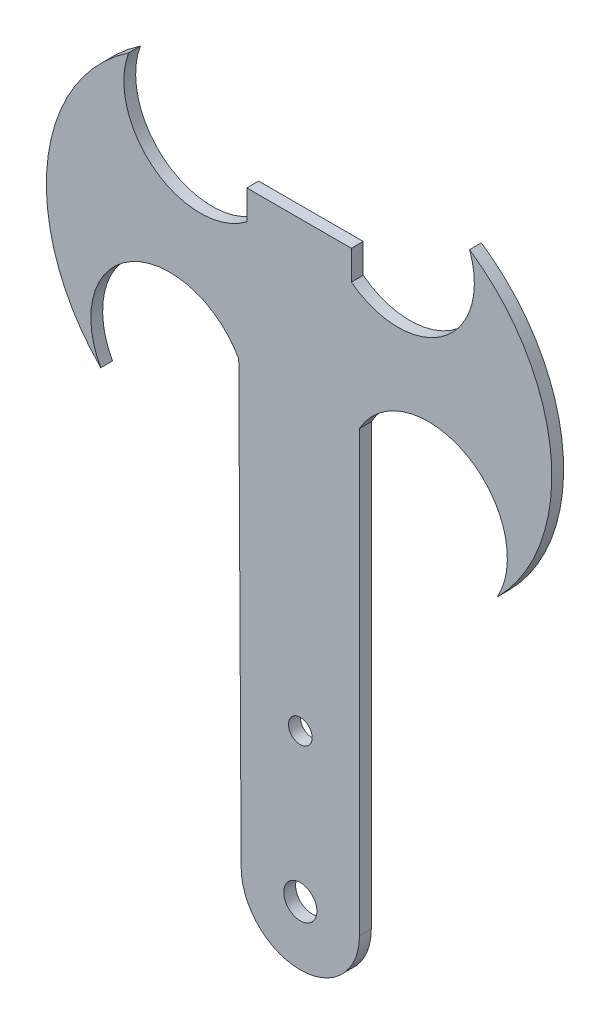
ISO-10303-21;
HEADER;
FILE_DESCRIPTION(('STEP AP214'),'2;1');
FILE_NAME('part.step','',(''),(''),'','','');
FILE_SCHEMA(('AUTOMOTIVE_DESIGN { 1 0 10303 214 1 1 1 1 }'));
ENDSEC;
DATA;
#1=APPLICATION_CONTEXT('core data for automotive mechanical design processes');
#2=APPLICATION_PROTOCOL_DEFINITION('international standard','automotive_design',2000,#1);
#3=PRODUCT_CONTEXT('',#1,'mechanical');
#4=PRODUCT('Part','Part','',(#3));
#5=PRODUCT_RELATED_PRODUCT_CATEGORY('part','',(#4));
#6=PRODUCT_DEFINITION_FORMATION('','',#4);
#7=PRODUCT_DEFINITION_CONTEXT('part definition',#1,'design');
#8=PRODUCT_DEFINITION('design','',#6,#7);
#9=PRODUCT_DEFINITION_SHAPE('','',#8);
#10=(LENGTH_UNIT() NAMED_UNIT(*) SI_UNIT(.MILLI.,.METRE.));
#11=(NAMED_UNIT(*) PLANE_ANGLE_UNIT() SI_UNIT($,.RADIAN.));
#12=(NAMED_UNIT(*) SI_UNIT($,.STERADIAN.) SOLID_ANGLE_UNIT());
#13=UNCERTAINTY_MEASURE_WITH_UNIT(LENGTH_MEASURE(1.E-05),#10,'distance_accuracy_value','');
#14=(GEOMETRIC_REPRESENTATION_CONTEXT(3) GLOBAL_UNCERTAINTY_ASSIGNED_CONTEXT((#13)) GLOBAL_UNIT_ASSIGNED_CONTEXT((#10,
#11,#12)) REPRESENTATION_CONTEXT('',''));
#15=CARTESIAN_POINT('',(0.,0.,0.));
#16=DIRECTION('',(0.,0.,1.));
#17=DIRECTION('',(1.,0.,0.));
#18=AXIS2_PLACEMENT_3D('',#15,#16,#17);
#19=CARTESIAN_POINT('',(34.1671418096591,18.1404890832739,-1.));
#20=DIRECTION('',(0.,0.,1.));
#21=DIRECTION('',(1.,0.,0.));
#22=AXIS2_PLACEMENT_3D('',#19,#20,#21);
#23=CYLINDRICAL_SURFACE('',#22,6.67397065018017);
#24=CARTESIAN_POINT('',(34.1671418096591,18.1404890832739,0.));
#25=DIRECTION('',(0.,0.,-1.));
#26=DIRECTION('',(1.,0.,0.));
#27=AXIS2_PLACEMENT_3D('',#24,#25,#26);
#28=CIRCLE('',#27,6.67397065018017);
#29=CARTESIAN_POINT('',(28.3342836193181,14.8970881566478,0.));
#30=VERTEX_POINT('',#29);
#31=CARTESIAN_POINT('',(40.,21.3838900099,0.));
#32=VERTEX_POINT('',#31);
#33=EDGE_CURVE('E158',#30,#32,#28,.T.);
#34=ORIENTED_EDGE('',*,*,#33,.F.);
#35=DIRECTION('',(0.,0.,1.));
#36=VECTOR('',#35,1.);
#37=CARTESIAN_POINT('',(28.3342836193181,14.8970881566478,-1.));
#38=LINE('',#37,#36);
#39=CARTESIAN_POINT('',(28.3342836193181,14.8970881566478,-1.));
#40=VERTEX_POINT('',#39);
#41=EDGE_CURVE('E11',#40,#30,#38,.T.);
#42=ORIENTED_EDGE('',*,*,#41,.F.);
#43=CARTESIAN_POINT('',(34.1671418096591,18.1404890832739,-1.));
#44=DIRECTION('',(0.,0.,-1.));
#45=DIRECTION('',(1.,0.,0.));
#46=AXIS2_PLACEMENT_3D('',#43,#44,#45);
#47=CIRCLE('',#46,6.67397065018017);
#48=CARTESIAN_POINT('',(40.,21.3838900099,-1.));
#49=VERTEX_POINT('',#48);
#50=EDGE_CURVE('E191',#40,#49,#47,.T.);
#51=ORIENTED_EDGE('',*,*,#50,.T.);
#52=DIRECTION('',(0.,0.,1.));
#53=VECTOR('',#52,1.);
#54=CARTESIAN_POINT('',(40.,21.3838900099,-1.));
#55=LINE('',#54,#53);
#56=EDGE_CURVE('E40',#49,#32,#55,.T.);
#57=ORIENTED_EDGE('',*,*,#56,.T.);
#58=EDGE_LOOP('',(#34,#42,#51,#57));
#59=FACE_BOUND('',#58,.T.);
#60=ADVANCED_FACE('F37',(#59),#23,.F.);
#61=CARTESIAN_POINT('',(39.5394646865,26.0428552188,-1.));
#62=DIRECTION('',(0.,0.,1.));
#63=DIRECTION('',(1.,0.,0.));
#64=AXIS2_PLACEMENT_3D('',#61,#62,#63);
#65=CYLINDRICAL_SURFACE('',#64,15.8045628269841);
#66=CARTESIAN_POINT('',(39.5394646865,26.0428552188,0.));
#67=DIRECTION('',(0.,0.,1.));
#68=DIRECTION('',(1.,0.,0.));
#69=AXIS2_PLACEMENT_3D('',#66,#67,#68);
#70=CIRCLE('',#69,15.8045628269841);
#71=CARTESIAN_POINT('',(30.6895364843728,39.137242450331,0.));
#72=VERTEX_POINT('',#71);
#73=EDGE_CURVE('E189',#72,#30,#70,.T.);
#74=ORIENTED_EDGE('',*,*,#73,.F.);
#75=DIRECTION('',(0.,0.,1.));
#76=VECTOR('',#75,1.);
#77=CARTESIAN_POINT('',(30.6895364843728,39.137242450331,-1.));
#78=LINE('',#77,#76);
#79=CARTESIAN_POINT('',(30.6895364843728,39.137242450331,-1.));
#80=VERTEX_POINT('',#79);
#81=EDGE_CURVE('E46',#80,#72,#78,.T.);
#82=ORIENTED_EDGE('',*,*,#81,.F.);
#83=CARTESIAN_POINT('',(39.5394646865,26.0428552188,-1.));
#84=DIRECTION('',(0.,0.,1.));
#85=DIRECTION('',(1.,0.,0.));
#86=AXIS2_PLACEMENT_3D('',#83,#84,#85);
#87=CIRCLE('',#86,15.8045628269841);
#88=EDGE_CURVE('E148',#80,#40,#87,.T.);
#89=ORIENTED_EDGE('',*,*,#88,.T.);
#90=ORIENTED_EDGE('',*,*,#41,.T.);
#91=EDGE_LOOP('',(#74,#82,#89,#90));
#92=FACE_BOUND('',#91,.T.);
#93=ADVANCED_FACE('F211',(#92),#65,.T.);
#94=CARTESIAN_POINT('',(36.7445164078923,36.8849972617035,-1.));
#95=DIRECTION('',(0.,0.,1.));
#96=DIRECTION('',(1.,0.,0.));
#97=AXIS2_PLACEMENT_3D('',#94,#95,#96);
#98=CYLINDRICAL_SURFACE('',#97,6.46029335741965);
#99=CARTESIAN_POINT('',(36.7445164078923,36.8849972617035,0.));
#100=DIRECTION('',(0.,0.,-1.));
#101=DIRECTION('',(1.,0.,0.));
#102=AXIS2_PLACEMENT_3D('',#99,#100,#101);
#103=CIRCLE('',#102,6.46029335741965);
#104=CARTESIAN_POINT('',(40.6819678488,31.7632918412,0.));
#105=VERTEX_POINT('',#104);
#106=EDGE_CURVE('E135',#105,#72,#103,.T.);
#107=ORIENTED_EDGE('',*,*,#106,.F.);
#108=DIRECTION('',(0.,0.,1.));
#109=VECTOR('',#108,1.);
#110=CARTESIAN_POINT('',(40.6819678488,31.7632918412,-1.));
#111=LINE('',#110,#109);
#112=CARTESIAN_POINT('',(40.6819678488,31.7632918412,-1.));
#113=VERTEX_POINT('',#112);
#114=EDGE_CURVE('E130',#113,#105,#111,.T.);
#115=ORIENTED_EDGE('',*,*,#114,.F.);
#116=CARTESIAN_POINT('',(36.7445164078923,36.8849972617035,-1.));
#117=DIRECTION('',(0.,0.,-1.));
#118=DIRECTION('',(1.,0.,0.));
#119=AXIS2_PLACEMENT_3D('',#116,#117,#118);
#120=CIRCLE('',#119,6.46029335741965);
#121=EDGE_CURVE('E133',#113,#80,#120,.T.);
#122=ORIENTED_EDGE('',*,*,#121,.T.);
#123=ORIENTED_EDGE('',*,*,#81,.T.);
#124=EDGE_LOOP('',(#107,#115,#122,#123));
#125=FACE_BOUND('',#124,.T.);
#126=ADVANCED_FACE('F132',(#125),#98,.F.);
#127=CARTESIAN_POINT('',(40.6819678488,34.2436901751,-1.));
#128=DIRECTION('',(-1.,0.,0.));
#129=DIRECTION('',(0.,0.,1.));
#130=AXIS2_PLACEMENT_3D('',#127,#128,#129);
#131=PLANE('',#130);
#132=DIRECTION('',(0.,-1.,0.));
#133=VECTOR('',#132,1.);
#134=CARTESIAN_POINT('',(40.6819678488,34.2436901751,0.));
#135=LINE('',#134,#133);
#136=CARTESIAN_POINT('',(40.6819678488,34.2436901751,0.));
#137=VERTEX_POINT('',#136);
#138=EDGE_CURVE('E186',#137,#105,#135,.T.);
#139=ORIENTED_EDGE('',*,*,#138,.F.);
#140=DIRECTION('',(0.,0.,1.));
#141=VECTOR('',#140,1.);
#142=CARTESIAN_POINT('',(40.6819678488,34.2436901751,-1.));
#143=LINE('',#142,#141);
#144=CARTESIAN_POINT('',(40.6819678488,34.2436901751,-1.));
#145=VERTEX_POINT('',#144);
#146=EDGE_CURVE('E140',#145,#137,#143,.T.);
#147=ORIENTED_EDGE('',*,*,#146,.F.);
#148=DIRECTION('',(0.,-1.,0.));
#149=VECTOR('',#148,1.);
#150=CARTESIAN_POINT('',(40.6819678488,34.2436901751,-1.));
#151=LINE('',#150,#149);
#152=EDGE_CURVE('E146',#145,#113,#151,.T.);
#153=ORIENTED_EDGE('',*,*,#152,.T.);
#154=ORIENTED_EDGE('',*,*,#114,.T.);
#155=EDGE_LOOP('',(#139,#147,#153,#154));
#156=FACE_BOUND('',#155,.T.);
#157=ADVANCED_FACE('F150',(#156),#131,.T.);
#158=CARTESIAN_POINT('',(49.5240225671,34.2436901751,-1.));
#159=DIRECTION('',(0.,1.,0.));
#160=DIRECTION('',(0.,0.,1.));
#161=AXIS2_PLACEMENT_3D('',#158,#159,#160);
#162=PLANE('',#161);
#163=DIRECTION('',(-1.,0.,0.));
#164=VECTOR('',#163,1.);
#165=CARTESIAN_POINT('',(49.5240225671,34.2436901751,0.));
#166=LINE('',#165,#164);
#167=CARTESIAN_POINT('',(49.5240225671,34.2436901751,0.));
#168=VERTEX_POINT('',#167);
#169=EDGE_CURVE('E183',#168,#137,#166,.T.);
#170=ORIENTED_EDGE('',*,*,#169,.F.);
#171=DIRECTION('',(0.,0.,1.));
#172=VECTOR('',#171,1.);
#173=CARTESIAN_POINT('',(49.5240225671,34.2436901751,-1.));
#174=LINE('',#173,#172);
#175=CARTESIAN_POINT('',(49.5240225671,34.2436901751,-1.));
#176=VERTEX_POINT('',#175);
#177=EDGE_CURVE('E195',#176,#168,#174,.T.);
#178=ORIENTED_EDGE('',*,*,#177,.F.);
#179=DIRECTION('',(-1.,0.,0.));
#180=VECTOR('',#179,1.);
#181=CARTESIAN_POINT('',(49.5240225671,34.2436901751,-1.));
#182=LINE('',#181,#180);
#183=EDGE_CURVE('E151',#176,#145,#182,.T.);
#184=ORIENTED_EDGE('',*,*,#183,.T.);
#185=ORIENTED_EDGE('',*,*,#146,.T.);
#186=EDGE_LOOP('',(#170,#178,#184,#185));
#187=FACE_BOUND('',#186,.T.);
#188=ADVANCED_FACE('F224',(#187),#162,.T.);
#189=CARTESIAN_POINT('',(49.5240225671,31.7632918412,-1.));
#190=DIRECTION('',(1.,0.,0.));
#191=DIRECTION('',(0.,0.,-1.));
#192=AXIS2_PLACEMENT_3D('',#189,#190,#191);
#193=PLANE('',#192);
#194=DIRECTION('',(0.,1.,0.));
#195=VECTOR('',#194,1.);
#196=CARTESIAN_POINT('',(49.5240225671,31.7632918412,0.));
#197=LINE('',#196,#195);
#198=CARTESIAN_POINT('',(49.5240225671,31.7632918412,0.));
#199=VERTEX_POINT('',#198);
#200=EDGE_CURVE('E180',#199,#168,#197,.T.);
#201=ORIENTED_EDGE('',*,*,#200,.F.);
#202=DIRECTION('',(0.,0.,1.));
#203=VECTOR('',#202,1.);
#204=CARTESIAN_POINT('',(49.5240225671,31.7632918412,-1.));
#205=LINE('',#204,#203);
#206=CARTESIAN_POINT('',(49.5240225671,31.7632918412,-1.));
#207=VERTEX_POINT('',#206);
#208=EDGE_CURVE('E197',#207,#199,#205,.T.);
#209=ORIENTED_EDGE('',*,*,#208,.F.);
#210=DIRECTION('',(0.,1.,0.));
#211=VECTOR('',#210,1.);
#212=CARTESIAN_POINT('',(49.5240225671,31.7632918412,-1.));
#213=LINE('',#212,#211);
#214=EDGE_CURVE('E153',#207,#176,#213,.T.);
#215=ORIENTED_EDGE('',*,*,#214,.T.);
#216=ORIENTED_EDGE('',*,*,#177,.T.);
#217=EDGE_LOOP('',(#201,#209,#215,#216));
#218=FACE_BOUND('',#217,.T.);
#219=ADVANCED_FACE('F227',(#218),#193,.T.);
#220=CARTESIAN_POINT('',(53.4614740079072,36.8849972617807,-1.));
#221=DIRECTION('',(0.,0.,1.));
#222=DIRECTION('',(1.,0.,0.));
#223=AXIS2_PLACEMENT_3D('',#220,#221,#222);
#224=CYLINDRICAL_SURFACE('',#223,6.46029335741965);
#225=CARTESIAN_POINT('',(53.4614740079072,36.8849972617807,0.));
#226=DIRECTION('',(0.,0.,-1.));
#227=DIRECTION('',(1.,0.,0.));
#228=AXIS2_PLACEMENT_3D('',#225,#226,#227);
#229=CIRCLE('',#228,6.46029335741965);
#230=CARTESIAN_POINT('',(59.5164539314506,39.137242450344,0.));
#231=VERTEX_POINT('',#230);
#232=EDGE_CURVE('E177',#231,#199,#229,.T.);
#233=ORIENTED_EDGE('',*,*,#232,.F.);
#234=DIRECTION('',(0.,0.,1.));
#235=VECTOR('',#234,1.);
#236=CARTESIAN_POINT('',(59.5164539314506,39.137242450344,-1.));
#237=LINE('',#236,#235);
#238=CARTESIAN_POINT('',(59.5164539314506,39.137242450344,-1.));
#239=VERTEX_POINT('',#238);
#240=EDGE_CURVE('E199',#239,#231,#237,.T.);
#241=ORIENTED_EDGE('',*,*,#240,.F.);
#242=CARTESIAN_POINT('',(53.4614740079072,36.8849972617807,-1.));
#243=DIRECTION('',(0.,0.,-1.));
#244=DIRECTION('',(1.,0.,0.));
#245=AXIS2_PLACEMENT_3D('',#242,#243,#244);
#246=CIRCLE('',#245,6.46029335741965);
#247=EDGE_CURVE('E301',#239,#207,#246,.T.);
#248=ORIENTED_EDGE('',*,*,#247,.T.);
#249=ORIENTED_EDGE('',*,*,#208,.T.);
#250=EDGE_LOOP('',(#233,#241,#248,#249));
#251=FACE_BOUND('',#250,.T.);
#252=ADVANCED_FACE('F231',(#251),#224,.F.);
#253=CARTESIAN_POINT('',(50.6665257293172,26.0428552188173,-1.));
#254=DIRECTION('',(0.,0.,1.));
#255=DIRECTION('',(1.,0.,0.));
#256=AXIS2_PLACEMENT_3D('',#253,#254,#255);
#257=CYLINDRICAL_SURFACE('',#256,15.8045628269841);
#258=CARTESIAN_POINT('',(50.6665257293172,26.0428552188173,0.));
#259=DIRECTION('',(0.,0.,1.));
#260=DIRECTION('',(1.,0.,0.));
#261=AXIS2_PLACEMENT_3D('',#258,#259,#260);
#262=CIRCLE('',#261,15.8045628269841);
#263=CARTESIAN_POINT('',(61.8717067965013,14.8970881566674,0.));
#264=VERTEX_POINT('',#263);
#265=EDGE_CURVE('E174',#264,#231,#262,.T.);
#266=ORIENTED_EDGE('',*,*,#265,.F.);
#267=DIRECTION('',(0.,0.,1.));
#268=VECTOR('',#267,1.);
#269=CARTESIAN_POINT('',(61.8717067965013,14.8970881566674,-1.));
#270=LINE('',#269,#268);
#271=CARTESIAN_POINT('',(61.8717067965013,14.8970881566674,-1.));
#272=VERTEX_POINT('',#271);
#273=EDGE_CURVE('E201',#272,#264,#270,.T.);
#274=ORIENTED_EDGE('',*,*,#273,.F.);
#275=CARTESIAN_POINT('',(50.6665257293172,26.0428552188173,-1.));
#276=DIRECTION('',(0.,0.,1.));
#277=DIRECTION('',(1.,0.,0.));
#278=AXIS2_PLACEMENT_3D('',#275,#276,#277);
#279=CIRCLE('',#278,15.8045628269841);
#280=EDGE_CURVE('E298',#272,#239,#279,.T.);
#281=ORIENTED_EDGE('',*,*,#280,.T.);
#282=ORIENTED_EDGE('',*,*,#240,.T.);
#283=EDGE_LOOP('',(#266,#274,#281,#282));
#284=FACE_BOUND('',#283,.T.);
#285=ADVANCED_FACE('F235',(#284),#257,.T.);
#286=CARTESIAN_POINT('',(56.0388486061507,18.1404890832837,-1.));
#287=DIRECTION('',(0.,0.,1.));
#288=DIRECTION('',(1.,0.,0.));
#289=AXIS2_PLACEMENT_3D('',#286,#287,#288);
#290=CYLINDRICAL_SURFACE('',#289,6.67397065018392);
#291=CARTESIAN_POINT('',(56.0388486061507,18.1404890832837,0.));
#292=DIRECTION('',(0.,0.,-1.));
#293=DIRECTION('',(1.,0.,0.));
#294=AXIS2_PLACEMENT_3D('',#291,#292,#293);
#295=CIRCLE('',#294,6.67397065018392);
#296=CARTESIAN_POINT('',(50.2059904158,21.3838900099,0.));
#297=VERTEX_POINT('',#296);
#298=EDGE_CURVE('E171',#297,#264,#295,.T.);
#299=ORIENTED_EDGE('',*,*,#298,.F.);
#300=DIRECTION('',(0.,0.,1.));
#301=VECTOR('',#300,1.);
#302=CARTESIAN_POINT('',(50.2059904158,21.3838900099,-1.));
#303=LINE('',#302,#301);
#304=CARTESIAN_POINT('',(50.2059904158,21.3838900099,-1.));
#305=VERTEX_POINT('',#304);
#306=EDGE_CURVE('E203',#305,#297,#303,.T.);
#307=ORIENTED_EDGE('',*,*,#306,.F.);
#308=CARTESIAN_POINT('',(56.0388486061507,18.1404890832837,-1.));
#309=DIRECTION('',(0.,0.,-1.));
#310=DIRECTION('',(1.,0.,0.));
#311=AXIS2_PLACEMENT_3D('',#308,#309,#310);
#312=CIRCLE('',#311,6.67397065018392);
#313=EDGE_CURVE('E295',#305,#272,#312,.T.);
#314=ORIENTED_EDGE('',*,*,#313,.T.);
#315=ORIENTED_EDGE('',*,*,#273,.T.);
#316=EDGE_LOOP('',(#299,#307,#314,#315));
#317=FACE_BOUND('',#316,.T.);
#318=ADVANCED_FACE('F239',(#317),#290,.F.);
#319=CARTESIAN_POINT('',(50.2059904158,-15.7615636174,-1.));
#320=DIRECTION('',(1.,0.,0.));
#321=DIRECTION('',(0.,0.,-1.));
#322=AXIS2_PLACEMENT_3D('',#319,#320,#321);
#323=PLANE('',#322);
#324=DIRECTION('',(0.,1.,0.));
#325=VECTOR('',#324,1.);
#326=CARTESIAN_POINT('',(50.2059904158,-15.7615636174,0.));
#327=LINE('',#326,#325);
#328=CARTESIAN_POINT('',(50.2059904158,-15.7615636174,0.));
#329=VERTEX_POINT('',#328);
#330=EDGE_CURVE('E168',#329,#297,#327,.T.);
#331=ORIENTED_EDGE('',*,*,#330,.F.);
#332=DIRECTION('',(0.,0.,1.));
#333=VECTOR('',#332,1.);
#334=CARTESIAN_POINT('',(50.2059904158,-15.7615636174,-1.));
#335=LINE('',#334,#333);
#336=CARTESIAN_POINT('',(50.2059904158,-15.7615636174,-1.));
#337=VERTEX_POINT('',#336);
#338=EDGE_CURVE('E205',#337,#329,#335,.T.);
#339=ORIENTED_EDGE('',*,*,#338,.F.);
#340=DIRECTION('',(0.,1.,0.));
#341=VECTOR('',#340,1.);
#342=CARTESIAN_POINT('',(50.2059904158,-15.7615636174,-1.));
#343=LINE('',#342,#341);
#344=EDGE_CURVE('E292',#337,#305,#343,.T.);
#345=ORIENTED_EDGE('',*,*,#344,.T.);
#346=ORIENTED_EDGE('',*,*,#306,.T.);
#347=EDGE_LOOP('',(#331,#339,#345,#346));
#348=FACE_BOUND('',#347,.T.);
#349=ADVANCED_FACE('F243',(#348),#323,.T.);
#350=CARTESIAN_POINT('',(45.2059904079,-15.7615616,-1.));
#351=DIRECTION('',(0.,0.,1.));
#352=DIRECTION('',(1.,0.,0.));
#353=AXIS2_PLACEMENT_3D('',#350,#351,#352);
#354=CYLINDRICAL_SURFACE('',#353,5.00000000790041);
#355=CARTESIAN_POINT('',(45.2059904079,-15.7615616,0.));
#356=DIRECTION('',(0.,0.,1.));
#357=DIRECTION('',(1.,0.,0.));
#358=AXIS2_PLACEMENT_3D('',#355,#356,#357);
#359=CIRCLE('',#358,5.00000000790041);
#360=CARTESIAN_POINT('',(40.2059904,-15.7615636174,0.));
#361=VERTEX_POINT('',#360);
#362=EDGE_CURVE('E165',#361,#329,#359,.T.);
#363=ORIENTED_EDGE('',*,*,#362,.F.);
#364=DIRECTION('',(0.,0.,1.));
#365=VECTOR('',#364,1.);
#366=CARTESIAN_POINT('',(40.2059904,-15.7615636174,-1.));
#367=LINE('',#366,#365);
#368=CARTESIAN_POINT('',(40.2059904,-15.7615636174,-1.));
#369=VERTEX_POINT('',#368);
#370=EDGE_CURVE('E206',#369,#361,#367,.T.);
#371=ORIENTED_EDGE('',*,*,#370,.F.);
#372=CARTESIAN_POINT('',(45.2059904079,-15.7615616,-1.));
#373=DIRECTION('',(0.,0.,1.));
#374=DIRECTION('',(1.,0.,0.));
#375=AXIS2_PLACEMENT_3D('',#372,#373,#374);
#376=CIRCLE('',#375,5.00000000790041);
#377=EDGE_CURVE('E289',#369,#337,#376,.T.);
#378=ORIENTED_EDGE('',*,*,#377,.T.);
#379=ORIENTED_EDGE('',*,*,#338,.T.);
#380=EDGE_LOOP('',(#363,#371,#378,#379));
#381=FACE_BOUND('',#380,.T.);
#382=ADVANCED_FACE('F247',(#381),#354,.T.);
#383=CARTESIAN_POINT('',(40.,21.3838900099,-1.));
#384=DIRECTION('',(-0.99998462402668,-0.00554542245637593,0.));
#385=DIRECTION('',(0.00554542245637593,-0.99998462402668,0.));
#386=AXIS2_PLACEMENT_3D('',#383,#384,#385);
#387=PLANE('',#386);
#388=DIRECTION('',(0.00554542245637593,-0.99998462402668,0.));
#389=VECTOR('',#388,1.);
#390=CARTESIAN_POINT('',(40.,21.3838900099,0.));
#391=LINE('',#390,#389);
#392=EDGE_CURVE('E161',#32,#361,#391,.T.);
#393=ORIENTED_EDGE('',*,*,#392,.F.);
#394=ORIENTED_EDGE('',*,*,#56,.F.);
#395=DIRECTION('',(0.00554542245637593,-0.99998462402668,0.));
#396=VECTOR('',#395,1.);
#397=CARTESIAN_POINT('',(40.,21.3838900099,-1.));
#398=LINE('',#397,#396);
#399=EDGE_CURVE('E287',#49,#369,#398,.T.);
#400=ORIENTED_EDGE('',*,*,#399,.T.);
#401=ORIENTED_EDGE('',*,*,#370,.T.);
#402=EDGE_LOOP('',(#393,#394,#400,#401));
#403=FACE_BOUND('',#402,.T.);
#404=ADVANCED_FACE('F208',(#403),#387,.T.);
#405=CARTESIAN_POINT('',(34.1671418096591,18.1404890832739,-1.));
#406=DIRECTION('',(0.,0.,1.));
#407=DIRECTION('',(1.,0.,0.));
#408=AXIS2_PLACEMENT_3D('',#405,#406,#407);
#409=PLANE('',#408);
#410=CARTESIAN_POINT('',(45.2059904079,-3.2615616,-1.));
#411=DIRECTION('',(0.,0.,1.));
#412=DIRECTION('',(1.,0.,0.));
#413=AXIS2_PLACEMENT_3D('',#410,#411,#412);
#414=CIRCLE('',#413,0.999999999958402);
#415=CARTESIAN_POINT('',(46.2059904078584,-3.2615616,-1.));
#416=VERTEX_POINT('',#415);
#417=EDGE_CURVE('E274',#416,#416,#414,.T.);
#418=ORIENTED_EDGE('',*,*,#417,.T.);
#419=EDGE_LOOP('',(#418));
#420=FACE_BOUND('',#419,.T.);
#421=CARTESIAN_POINT('',(45.2059904079,-15.7615616,-1.));
#422=DIRECTION('',(0.,0.,1.));
#423=DIRECTION('',(1.,0.,0.));
#424=AXIS2_PLACEMENT_3D('',#421,#422,#423);
#425=CIRCLE('',#424,1.3999999999584);
#426=CARTESIAN_POINT('',(46.6059904078584,-15.7615616,-1.));
#427=VERTEX_POINT('',#426);
#428=EDGE_CURVE('E162',#427,#427,#425,.T.);
#429=ORIENTED_EDGE('',*,*,#428,.T.);
#430=EDGE_LOOP('',(#429));
#431=FACE_BOUND('',#430,.T.);
#432=ORIENTED_EDGE('',*,*,#50,.F.);
#433=ORIENTED_EDGE('',*,*,#88,.F.);
#434=ORIENTED_EDGE('',*,*,#121,.F.);
#435=ORIENTED_EDGE('',*,*,#152,.F.);
#436=ORIENTED_EDGE('',*,*,#183,.F.);
#437=ORIENTED_EDGE('',*,*,#214,.F.);
#438=ORIENTED_EDGE('',*,*,#247,.F.);
#439=ORIENTED_EDGE('',*,*,#280,.F.);
#440=ORIENTED_EDGE('',*,*,#313,.F.);
#441=ORIENTED_EDGE('',*,*,#344,.F.);
#442=ORIENTED_EDGE('',*,*,#377,.F.);
#443=ORIENTED_EDGE('',*,*,#399,.F.);
#444=EDGE_LOOP('',(#432,#433,#434,#435,#436,#437,#438,#439,#440,#441,#442,#443));
#445=FACE_BOUND('',#444,.T.);
#446=ADVANCED_FACE('F144',(#420,#431,#445),#409,.F.);
#447=CARTESIAN_POINT('',(34.1671418096591,18.1404890832739,0.));
#448=DIRECTION('',(0.,0.,1.));
#449=DIRECTION('',(1.,0.,0.));
#450=AXIS2_PLACEMENT_3D('',#447,#448,#449);
#451=PLANE('',#450);
#452=CARTESIAN_POINT('',(45.2059904079,-3.2615616,0.));
#453=DIRECTION('',(0.,0.,1.));
#454=DIRECTION('',(1.,0.,0.));
#455=AXIS2_PLACEMENT_3D('',#452,#453,#454);
#456=CIRCLE('',#455,0.999999999958402);
#457=CARTESIAN_POINT('',(46.2059904078584,-3.2615616,0.));
#458=VERTEX_POINT('',#457);
#459=EDGE_CURVE('E277',#458,#458,#456,.T.);
#460=ORIENTED_EDGE('',*,*,#459,.F.);
#461=EDGE_LOOP('',(#460));
#462=FACE_BOUND('',#461,.T.);
#463=CARTESIAN_POINT('',(45.2059904079,-15.7615616,0.));
#464=DIRECTION('',(0.,0.,1.));
#465=DIRECTION('',(1.,0.,0.));
#466=AXIS2_PLACEMENT_3D('',#463,#464,#465);
#467=CIRCLE('',#466,1.3999999999584);
#468=CARTESIAN_POINT('',(46.6059904078584,-15.7615616,0.));
#469=VERTEX_POINT('',#468);
#470=EDGE_CURVE('E279',#469,#469,#467,.T.);
#471=ORIENTED_EDGE('',*,*,#470,.F.);
#472=EDGE_LOOP('',(#471));
#473=FACE_BOUND('',#472,.T.);
#474=ORIENTED_EDGE('',*,*,#33,.T.);
#475=ORIENTED_EDGE('',*,*,#392,.T.);
#476=ORIENTED_EDGE('',*,*,#362,.T.);
#477=ORIENTED_EDGE('',*,*,#330,.T.);
#478=ORIENTED_EDGE('',*,*,#298,.T.);
#479=ORIENTED_EDGE('',*,*,#265,.T.);
#480=ORIENTED_EDGE('',*,*,#232,.T.);
#481=ORIENTED_EDGE('',*,*,#200,.T.);
#482=ORIENTED_EDGE('',*,*,#169,.T.);
#483=ORIENTED_EDGE('',*,*,#138,.T.);
#484=ORIENTED_EDGE('',*,*,#106,.T.);
#485=ORIENTED_EDGE('',*,*,#73,.T.);
#486=EDGE_LOOP('',(#474,#475,#476,#477,#478,#479,#480,#481,#482,#483,#484,#485));
#487=FACE_BOUND('',#486,.T.);
#488=ADVANCED_FACE('F210',(#462,#473,#487),#451,.T.);
#489=CARTESIAN_POINT('',(45.2059904079,-15.7615616,-1.));
#490=DIRECTION('',(0.,0.,1.));
#491=DIRECTION('',(1.,0.,0.));
#492=AXIS2_PLACEMENT_3D('',#489,#490,#491);
#493=CYLINDRICAL_SURFACE('',#492,1.3999999999584);
#494=ORIENTED_EDGE('',*,*,#428,.F.);
#495=EDGE_LOOP('',(#494));
#496=FACE_BOUND('',#495,.T.);
#497=ORIENTED_EDGE('',*,*,#470,.T.);
#498=EDGE_LOOP('',(#497));
#499=FACE_BOUND('',#498,.T.);
#500=ADVANCED_FACE('F259',(#496,#499),#493,.F.);
#501=CARTESIAN_POINT('',(45.2059904079,-3.2615616,-1.));
#502=DIRECTION('',(0.,0.,1.));
#503=DIRECTION('',(1.,0.,0.));
#504=AXIS2_PLACEMENT_3D('',#501,#502,#503);
#505=CYLINDRICAL_SURFACE('',#504,0.999999999958402);
#506=ORIENTED_EDGE('',*,*,#417,.F.);
#507=EDGE_LOOP('',(#506));
#508=FACE_BOUND('',#507,.T.);
#509=ORIENTED_EDGE('',*,*,#459,.T.);
#510=EDGE_LOOP('',(#509));
#511=FACE_BOUND('',#510,.T.);
#512=ADVANCED_FACE('F266',(#508,#511),#505,.F.);
#513=CLOSED_SHELL('',(#60,#93,#126,#157,#188,#219,#252,#285,#318,#349,#382,#404,#446,#488,#500,#512));
#514=MANIFOLD_SOLID_BREP('B2',#513);
#515=ADVANCED_BREP_SHAPE_REPRESENTATION('',(#18,#514),#14);
#516=SHAPE_DEFINITION_REPRESENTATION(#9,#515);
ENDSEC;
END-ISO-10303-21;
